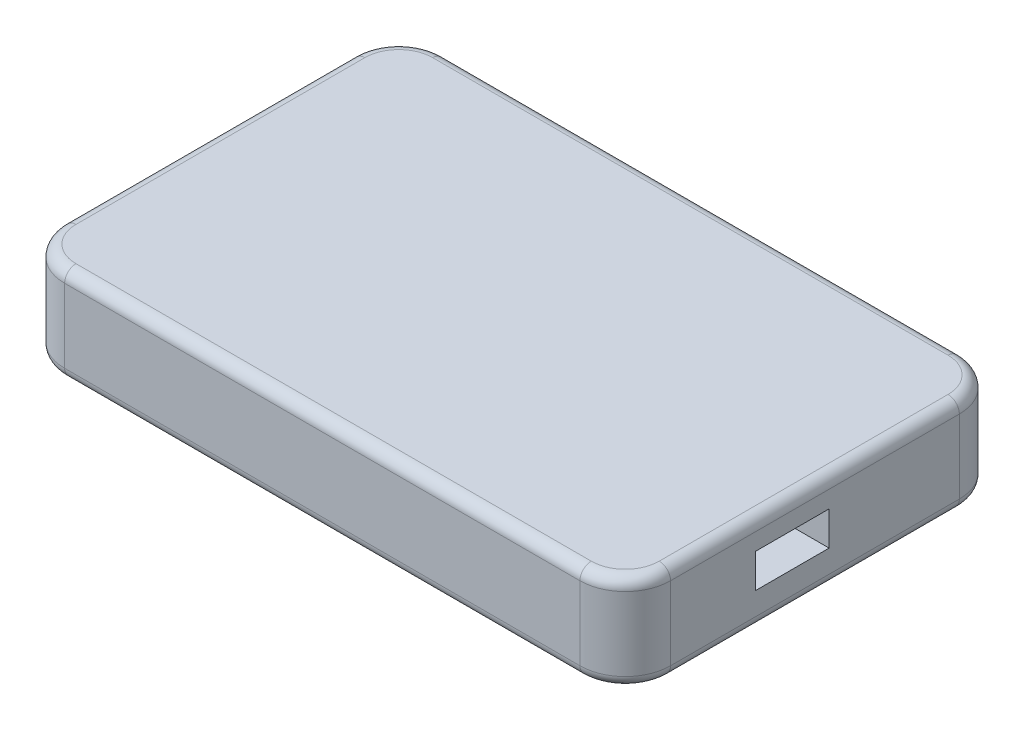
ISO-10303-21;
HEADER;
FILE_DESCRIPTION(('STEP AP214'),'2;1');
FILE_NAME('part.step','',(''),(''),'','','');
FILE_SCHEMA(('AUTOMOTIVE_DESIGN { 1 0 10303 214 1 1 1 1 }'));
ENDSEC;
DATA;
#1=APPLICATION_CONTEXT('core data for automotive mechanical design processes');
#2=APPLICATION_PROTOCOL_DEFINITION('international standard','automotive_design',2000,#1);
#3=PRODUCT_CONTEXT('',#1,'mechanical');
#4=PRODUCT('Part','Part','',(#3));
#5=PRODUCT_RELATED_PRODUCT_CATEGORY('part','',(#4));
#6=PRODUCT_DEFINITION_FORMATION('','',#4);
#7=PRODUCT_DEFINITION_CONTEXT('part definition',#1,'design');
#8=PRODUCT_DEFINITION('design','',#6,#7);
#9=PRODUCT_DEFINITION_SHAPE('','',#8);
#10=(LENGTH_UNIT() NAMED_UNIT(*) SI_UNIT(.MILLI.,.METRE.));
#11=(NAMED_UNIT(*) PLANE_ANGLE_UNIT() SI_UNIT($,.RADIAN.));
#12=(NAMED_UNIT(*) SI_UNIT($,.STERADIAN.) SOLID_ANGLE_UNIT());
#13=UNCERTAINTY_MEASURE_WITH_UNIT(LENGTH_MEASURE(1.E-05),#10,'distance_accuracy_value','');
#14=(GEOMETRIC_REPRESENTATION_CONTEXT(3) GLOBAL_UNCERTAINTY_ASSIGNED_CONTEXT((#13)) GLOBAL_UNIT_ASSIGNED_CONTEXT((#10,
#11,#12)) REPRESENTATION_CONTEXT('',''));
#15=CARTESIAN_POINT('',(0.,0.,0.));
#16=DIRECTION('',(0.,0.,1.));
#17=DIRECTION('',(1.,0.,0.));
#18=AXIS2_PLACEMENT_3D('',#15,#16,#17);
#19=CARTESIAN_POINT('',(53.5,17.,0.));
#20=DIRECTION('',(0.,-1.,0.));
#21=DIRECTION('',(0.,0.,-1.));
#22=AXIS2_PLACEMENT_3D('',#19,#20,#21);
#23=PLANE('',#22);
#24=CARTESIAN_POINT('',(-45.5,17.,-8.));
#25=DIRECTION('',(0.,-1.,0.));
#26=DIRECTION('',(0.,0.,-1.));
#27=AXIS2_PLACEMENT_3D('',#24,#25,#26);
#28=CIRCLE('',#27,6.);
#29=CARTESIAN_POINT('',(-45.5,17.,-2.));
#30=VERTEX_POINT('',#29);
#31=CARTESIAN_POINT('',(-51.5,17.,-8.));
#32=VERTEX_POINT('',#31);
#33=EDGE_CURVE('E328',#30,#32,#28,.T.);
#34=ORIENTED_EDGE('',*,*,#33,.F.);
#35=DIRECTION('',(-1.,0.,0.));
#36=VECTOR('',#35,1.);
#37=CARTESIAN_POINT('',(53.5,17.,-2.));
#38=LINE('',#37,#36);
#39=CARTESIAN_POINT('',(45.5,17.,-2.));
#40=VERTEX_POINT('',#39);
#41=EDGE_CURVE('E257',#30,#40,#38,.F.);
#42=ORIENTED_EDGE('',*,*,#41,.T.);
#43=CARTESIAN_POINT('',(45.5,17.,-8.));
#44=DIRECTION('',(0.,-1.,0.));
#45=DIRECTION('',(0.,0.,-1.));
#46=AXIS2_PLACEMENT_3D('',#43,#44,#45);
#47=CIRCLE('',#46,6.);
#48=CARTESIAN_POINT('',(51.5,17.,-8.));
#49=VERTEX_POINT('',#48);
#50=EDGE_CURVE('E324',#49,#40,#47,.T.);
#51=ORIENTED_EDGE('',*,*,#50,.F.);
#52=DIRECTION('',(0.,0.,1.));
#53=VECTOR('',#52,1.);
#54=CARTESIAN_POINT('',(51.5,17.,0.));
#55=LINE('',#54,#53);
#56=CARTESIAN_POINT('',(51.5,17.,-59.));
#57=VERTEX_POINT('',#56);
#58=EDGE_CURVE('E261',#49,#57,#55,.F.);
#59=ORIENTED_EDGE('',*,*,#58,.T.);
#60=CARTESIAN_POINT('',(45.5,17.,-59.));
#61=DIRECTION('',(0.,-1.,0.));
#62=DIRECTION('',(0.,0.,-1.));
#63=AXIS2_PLACEMENT_3D('',#60,#61,#62);
#64=CIRCLE('',#63,6.);
#65=CARTESIAN_POINT('',(45.5,17.,-65.));
#66=VERTEX_POINT('',#65);
#67=EDGE_CURVE('E321',#66,#57,#64,.T.);
#68=ORIENTED_EDGE('',*,*,#67,.F.);
#69=DIRECTION('',(-1.,0.,0.));
#70=VECTOR('',#69,1.);
#71=CARTESIAN_POINT('',(53.5,17.,-65.));
#72=LINE('',#71,#70);
#73=CARTESIAN_POINT('',(-45.5,17.,-65.));
#74=VERTEX_POINT('',#73);
#75=EDGE_CURVE('E269',#66,#74,#72,.T.);
#76=ORIENTED_EDGE('',*,*,#75,.T.);
#77=CARTESIAN_POINT('',(-45.5,17.,-59.));
#78=DIRECTION('',(0.,-1.,0.));
#79=DIRECTION('',(0.,0.,-1.));
#80=AXIS2_PLACEMENT_3D('',#77,#78,#79);
#81=CIRCLE('',#80,6.);
#82=CARTESIAN_POINT('',(-51.5,17.,-59.));
#83=VERTEX_POINT('',#82);
#84=EDGE_CURVE('E318',#83,#74,#81,.T.);
#85=ORIENTED_EDGE('',*,*,#84,.F.);
#86=DIRECTION('',(0.,0.,1.));
#87=VECTOR('',#86,1.);
#88=CARTESIAN_POINT('',(-51.5,17.,0.));
#89=LINE('',#88,#87);
#90=EDGE_CURVE('E265',#83,#32,#89,.T.);
#91=ORIENTED_EDGE('',*,*,#90,.T.);
#92=EDGE_LOOP('',(#34,#42,#51,#59,#68,#76,#85,#91));
#93=FACE_BOUND('',#92,.T.);
#94=ADVANCED_FACE('F41',(#93),#23,.F.);
#95=CARTESIAN_POINT('',(53.5,0.,0.));
#96=DIRECTION('',(0.,1.,0.));
#97=DIRECTION('',(0.,0.,1.));
#98=AXIS2_PLACEMENT_3D('',#95,#96,#97);
#99=PLANE('',#98);
#100=CARTESIAN_POINT('',(-45.5,0.,-8.));
#101=DIRECTION('',(0.,1.,0.));
#102=DIRECTION('',(0.,0.,1.));
#103=AXIS2_PLACEMENT_3D('',#100,#101,#102);
#104=CIRCLE('',#103,6.);
#105=CARTESIAN_POINT('',(-51.5,0.,-8.));
#106=VERTEX_POINT('',#105);
#107=CARTESIAN_POINT('',(-45.5,0.,-2.));
#108=VERTEX_POINT('',#107);
#109=EDGE_CURVE('E315',#106,#108,#104,.T.);
#110=ORIENTED_EDGE('',*,*,#109,.F.);
#111=DIRECTION('',(0.,0.,-1.));
#112=VECTOR('',#111,1.);
#113=CARTESIAN_POINT('',(-51.5,0.,-67.));
#114=LINE('',#113,#112);
#115=CARTESIAN_POINT('',(-51.5,0.,-59.));
#116=VERTEX_POINT('',#115);
#117=EDGE_CURVE('E242',#106,#116,#114,.T.);
#118=ORIENTED_EDGE('',*,*,#117,.T.);
#119=CARTESIAN_POINT('',(-45.5,0.,-59.));
#120=DIRECTION('',(0.,1.,0.));
#121=DIRECTION('',(0.,0.,1.));
#122=AXIS2_PLACEMENT_3D('',#119,#120,#121);
#123=CIRCLE('',#122,6.);
#124=CARTESIAN_POINT('',(-45.5,0.,-65.));
#125=VERTEX_POINT('',#124);
#126=EDGE_CURVE('E304',#125,#116,#123,.T.);
#127=ORIENTED_EDGE('',*,*,#126,.F.);
#128=DIRECTION('',(-1.,0.,0.));
#129=VECTOR('',#128,1.);
#130=CARTESIAN_POINT('',(53.5,0.,-65.));
#131=LINE('',#130,#129);
#132=CARTESIAN_POINT('',(45.5,0.,-65.));
#133=VERTEX_POINT('',#132);
#134=EDGE_CURVE('E246',#125,#133,#131,.F.);
#135=ORIENTED_EDGE('',*,*,#134,.T.);
#136=CARTESIAN_POINT('',(45.5,0.,-59.));
#137=DIRECTION('',(0.,1.,0.));
#138=DIRECTION('',(0.,0.,1.));
#139=AXIS2_PLACEMENT_3D('',#136,#137,#138);
#140=CIRCLE('',#139,6.);
#141=CARTESIAN_POINT('',(51.5,0.,-59.));
#142=VERTEX_POINT('',#141);
#143=EDGE_CURVE('E308',#142,#133,#140,.T.);
#144=ORIENTED_EDGE('',*,*,#143,.F.);
#145=DIRECTION('',(0.,0.,-1.));
#146=VECTOR('',#145,1.);
#147=CARTESIAN_POINT('',(51.5,0.,0.));
#148=LINE('',#147,#146);
#149=CARTESIAN_POINT('',(51.5,0.,-8.));
#150=VERTEX_POINT('',#149);
#151=EDGE_CURVE('E237',#142,#150,#148,.F.);
#152=ORIENTED_EDGE('',*,*,#151,.T.);
#153=CARTESIAN_POINT('',(45.5,0.,-8.));
#154=DIRECTION('',(0.,1.,0.));
#155=DIRECTION('',(0.,0.,1.));
#156=AXIS2_PLACEMENT_3D('',#153,#154,#155);
#157=CIRCLE('',#156,6.);
#158=CARTESIAN_POINT('',(45.5,0.,-2.));
#159=VERTEX_POINT('',#158);
#160=EDGE_CURVE('E312',#159,#150,#157,.T.);
#161=ORIENTED_EDGE('',*,*,#160,.F.);
#162=DIRECTION('',(-1.,0.,0.));
#163=VECTOR('',#162,1.);
#164=CARTESIAN_POINT('',(53.5,0.,-2.));
#165=LINE('',#164,#163);
#166=EDGE_CURVE('E233',#159,#108,#165,.T.);
#167=ORIENTED_EDGE('',*,*,#166,.T.);
#168=EDGE_LOOP('',(#110,#118,#127,#135,#144,#152,#161,#167));
#169=FACE_BOUND('',#168,.T.);
#170=ADVANCED_FACE('F436',(#169),#99,.F.);
#171=CARTESIAN_POINT('',(53.5,0.,0.));
#172=DIRECTION('',(0.,0.,-1.));
#173=DIRECTION('',(-1.,0.,0.));
#174=AXIS2_PLACEMENT_3D('',#171,#172,#173);
#175=PLANE('',#174);
#176=DIRECTION('',(-1.,0.,0.));
#177=VECTOR('',#176,1.);
#178=CARTESIAN_POINT('',(53.5,2.,0.));
#179=LINE('',#178,#177);
#180=CARTESIAN_POINT('',(-45.5,2.,0.));
#181=VERTEX_POINT('',#180);
#182=CARTESIAN_POINT('',(45.5,2.,0.));
#183=VERTEX_POINT('',#182);
#184=EDGE_CURVE('E293',#181,#183,#179,.F.);
#185=ORIENTED_EDGE('',*,*,#184,.T.);
#186=DIRECTION('',(0.,-1.,0.));
#187=VECTOR('',#186,1.);
#188=CARTESIAN_POINT('',(45.5,0.,0.));
#189=LINE('',#188,#187);
#190=CARTESIAN_POINT('',(45.5,15.,0.));
#191=VERTEX_POINT('',#190);
#192=EDGE_CURVE('E11',#183,#191,#189,.F.);
#193=ORIENTED_EDGE('',*,*,#192,.T.);
#194=DIRECTION('',(-1.,0.,0.));
#195=VECTOR('',#194,1.);
#196=CARTESIAN_POINT('',(53.5,15.,0.));
#197=LINE('',#196,#195);
#198=CARTESIAN_POINT('',(-45.5,15.,0.));
#199=VERTEX_POINT('',#198);
#200=EDGE_CURVE('E289',#191,#199,#197,.T.);
#201=ORIENTED_EDGE('',*,*,#200,.T.);
#202=DIRECTION('',(0.,-1.,0.));
#203=VECTOR('',#202,1.);
#204=CARTESIAN_POINT('',(-45.5,2.,0.));
#205=LINE('',#204,#203);
#206=EDGE_CURVE('E51',#199,#181,#205,.T.);
#207=ORIENTED_EDGE('',*,*,#206,.T.);
#208=EDGE_LOOP('',(#185,#193,#201,#207));
#209=FACE_BOUND('',#208,.T.);
#210=ADVANCED_FACE('F520',(#209),#175,.F.);
#211=CARTESIAN_POINT('',(53.5,0.,-67.));
#212=DIRECTION('',(0.,0.,1.));
#213=DIRECTION('',(1.,0.,0.));
#214=AXIS2_PLACEMENT_3D('',#211,#212,#213);
#215=PLANE('',#214);
#216=DIRECTION('',(-1.,0.,0.));
#217=VECTOR('',#216,1.);
#218=CARTESIAN_POINT('',(53.5,2.,-67.));
#219=LINE('',#218,#217);
#220=CARTESIAN_POINT('',(45.5,2.,-67.));
#221=VERTEX_POINT('',#220);
#222=CARTESIAN_POINT('',(-45.5,2.,-67.));
#223=VERTEX_POINT('',#222);
#224=EDGE_CURVE('E285',#221,#223,#219,.T.);
#225=ORIENTED_EDGE('',*,*,#224,.T.);
#226=DIRECTION('',(0.,1.,0.));
#227=VECTOR('',#226,1.);
#228=CARTESIAN_POINT('',(-45.5,15.,-67.));
#229=LINE('',#228,#227);
#230=CARTESIAN_POINT('',(-45.5,15.,-67.));
#231=VERTEX_POINT('',#230);
#232=EDGE_CURVE('E379',#223,#231,#229,.T.);
#233=ORIENTED_EDGE('',*,*,#232,.T.);
#234=DIRECTION('',(-1.,0.,0.));
#235=VECTOR('',#234,1.);
#236=CARTESIAN_POINT('',(53.5,15.,-67.));
#237=LINE('',#236,#235);
#238=CARTESIAN_POINT('',(45.5,15.,-67.));
#239=VERTEX_POINT('',#238);
#240=EDGE_CURVE('E281',#231,#239,#237,.F.);
#241=ORIENTED_EDGE('',*,*,#240,.T.);
#242=DIRECTION('',(0.,1.,0.));
#243=VECTOR('',#242,1.);
#244=CARTESIAN_POINT('',(45.5,0.,-67.));
#245=LINE('',#244,#243);
#246=EDGE_CURVE('E376',#239,#221,#245,.F.);
#247=ORIENTED_EDGE('',*,*,#246,.T.);
#248=EDGE_LOOP('',(#225,#233,#241,#247));
#249=FACE_BOUND('',#248,.T.);
#250=ADVANCED_FACE('F525',(#249),#215,.F.);
#251=CARTESIAN_POINT('',(53.5,0.,0.));
#252=DIRECTION('',(-1.,0.,0.));
#253=DIRECTION('',(0.,0.,1.));
#254=AXIS2_PLACEMENT_3D('',#251,#252,#253);
#255=PLANE('',#254);
#256=DIRECTION('',(0.,0.,-1.));
#257=VECTOR('',#256,1.);
#258=CARTESIAN_POINT('',(53.5,6.,-23.));
#259=LINE('',#258,#257);
#260=CARTESIAN_POINT('',(53.5,6.,-23.));
#261=VERTEX_POINT('',#260);
#262=CARTESIAN_POINT('',(53.5,6.,-36.));
#263=VERTEX_POINT('',#262);
#264=EDGE_CURVE('E218',#261,#263,#259,.T.);
#265=ORIENTED_EDGE('',*,*,#264,.F.);
#266=DIRECTION('',(0.,-1.,0.));
#267=VECTOR('',#266,1.);
#268=CARTESIAN_POINT('',(53.5,12.,-23.));
#269=LINE('',#268,#267);
#270=CARTESIAN_POINT('',(53.5,12.,-23.));
#271=VERTEX_POINT('',#270);
#272=EDGE_CURVE('E59',#271,#261,#269,.T.);
#273=ORIENTED_EDGE('',*,*,#272,.F.);
#274=DIRECTION('',(0.,0.,1.));
#275=VECTOR('',#274,1.);
#276=CARTESIAN_POINT('',(53.5,12.,-23.));
#277=LINE('',#276,#275);
#278=CARTESIAN_POINT('',(53.5,12.,-36.));
#279=VERTEX_POINT('',#278);
#280=EDGE_CURVE('E205',#279,#271,#277,.T.);
#281=ORIENTED_EDGE('',*,*,#280,.F.);
#282=DIRECTION('',(0.,1.,0.));
#283=VECTOR('',#282,1.);
#284=CARTESIAN_POINT('',(53.5,12.,-36.));
#285=LINE('',#284,#283);
#286=EDGE_CURVE('E209',#263,#279,#285,.T.);
#287=ORIENTED_EDGE('',*,*,#286,.F.);
#288=EDGE_LOOP('',(#265,#273,#281,#287));
#289=FACE_BOUND('',#288,.T.);
#290=DIRECTION('',(0.,0.,-1.));
#291=VECTOR('',#290,1.);
#292=CARTESIAN_POINT('',(53.5,2.,0.));
#293=LINE('',#292,#291);
#294=CARTESIAN_POINT('',(53.5,2.,-8.));
#295=VERTEX_POINT('',#294);
#296=CARTESIAN_POINT('',(53.5,2.,-59.));
#297=VERTEX_POINT('',#296);
#298=EDGE_CURVE('E277',#295,#297,#293,.T.);
#299=ORIENTED_EDGE('',*,*,#298,.T.);
#300=DIRECTION('',(0.,1.,0.));
#301=VECTOR('',#300,1.);
#302=CARTESIAN_POINT('',(53.5,0.,-59.));
#303=LINE('',#302,#301);
#304=CARTESIAN_POINT('',(53.5,15.,-59.));
#305=VERTEX_POINT('',#304);
#306=EDGE_CURVE('E391',#297,#305,#303,.T.);
#307=ORIENTED_EDGE('',*,*,#306,.T.);
#308=DIRECTION('',(0.,0.,1.));
#309=VECTOR('',#308,1.);
#310=CARTESIAN_POINT('',(53.5,15.,0.));
#311=LINE('',#310,#309);
#312=CARTESIAN_POINT('',(53.5,15.,-8.));
#313=VERTEX_POINT('',#312);
#314=EDGE_CURVE('E273',#305,#313,#311,.T.);
#315=ORIENTED_EDGE('',*,*,#314,.T.);
#316=DIRECTION('',(0.,-1.,0.));
#317=VECTOR('',#316,1.);
#318=CARTESIAN_POINT('',(53.5,0.,-8.));
#319=LINE('',#318,#317);
#320=EDGE_CURVE('E388',#313,#295,#319,.T.);
#321=ORIENTED_EDGE('',*,*,#320,.T.);
#322=EDGE_LOOP('',(#299,#307,#315,#321));
#323=FACE_BOUND('',#322,.T.);
#324=ADVANCED_FACE('F481',(#289,#323),#255,.F.);
#325=CARTESIAN_POINT('',(-53.5,0.,0.));
#326=DIRECTION('',(-1.,0.,0.));
#327=DIRECTION('',(0.,0.,1.));
#328=AXIS2_PLACEMENT_3D('',#325,#326,#327);
#329=PLANE('',#328);
#330=DIRECTION('',(0.,0.,1.));
#331=VECTOR('',#330,1.);
#332=CARTESIAN_POINT('',(-53.5,15.,-67.));
#333=LINE('',#332,#331);
#334=CARTESIAN_POINT('',(-53.5,15.,-8.));
#335=VERTEX_POINT('',#334);
#336=CARTESIAN_POINT('',(-53.5,15.,-59.));
#337=VERTEX_POINT('',#336);
#338=EDGE_CURVE('E250',#335,#337,#333,.F.);
#339=ORIENTED_EDGE('',*,*,#338,.T.);
#340=DIRECTION('',(0.,1.,0.));
#341=VECTOR('',#340,1.);
#342=CARTESIAN_POINT('',(-53.5,2.,-59.));
#343=LINE('',#342,#341);
#344=CARTESIAN_POINT('',(-53.5,2.,-59.));
#345=VERTEX_POINT('',#344);
#346=EDGE_CURVE('E385',#337,#345,#343,.F.);
#347=ORIENTED_EDGE('',*,*,#346,.T.);
#348=DIRECTION('',(0.,0.,-1.));
#349=VECTOR('',#348,1.);
#350=CARTESIAN_POINT('',(-53.5,2.,0.));
#351=LINE('',#350,#349);
#352=CARTESIAN_POINT('',(-53.5,2.,-8.));
#353=VERTEX_POINT('',#352);
#354=EDGE_CURVE('E254',#345,#353,#351,.F.);
#355=ORIENTED_EDGE('',*,*,#354,.T.);
#356=DIRECTION('',(0.,-1.,0.));
#357=VECTOR('',#356,1.);
#358=CARTESIAN_POINT('',(-53.5,15.,-8.));
#359=LINE('',#358,#357);
#360=EDGE_CURVE('E382',#353,#335,#359,.F.);
#361=ORIENTED_EDGE('',*,*,#360,.T.);
#362=EDGE_LOOP('',(#339,#347,#355,#361));
#363=FACE_BOUND('',#362,.T.);
#364=ADVANCED_FACE('F456',(#363),#329,.T.);
#365=CARTESIAN_POINT('',(51.5,2.,0.));
#366=DIRECTION('',(0.,0.,-1.));
#367=DIRECTION('',(-1.,0.,0.));
#368=AXIS2_PLACEMENT_3D('',#365,#366,#367);
#369=CYLINDRICAL_SURFACE('',#368,2.);
#370=ORIENTED_EDGE('',*,*,#298,.F.);
#371=CARTESIAN_POINT('',(51.5,2.,-8.));
#372=DIRECTION('',(0.,0.,-1.));
#373=DIRECTION('',(-1.,0.,0.));
#374=AXIS2_PLACEMENT_3D('',#371,#372,#373);
#375=CIRCLE('',#374,2.);
#376=EDGE_CURVE('E341',#295,#150,#375,.T.);
#377=ORIENTED_EDGE('',*,*,#376,.T.);
#378=ORIENTED_EDGE('',*,*,#151,.F.);
#379=CARTESIAN_POINT('',(51.5,2.,-59.));
#380=DIRECTION('',(0.,0.,1.));
#381=DIRECTION('',(1.,0.,0.));
#382=AXIS2_PLACEMENT_3D('',#379,#380,#381);
#383=CIRCLE('',#382,2.);
#384=EDGE_CURVE('E338',#142,#297,#383,.T.);
#385=ORIENTED_EDGE('',*,*,#384,.T.);
#386=EDGE_LOOP('',(#370,#377,#378,#385));
#387=FACE_BOUND('',#386,.T.);
#388=ADVANCED_FACE('F485',(#387),#369,.T.);
#389=CARTESIAN_POINT('',(53.5,2.,-2.));
#390=DIRECTION('',(-1.,0.,0.));
#391=DIRECTION('',(0.,0.,1.));
#392=AXIS2_PLACEMENT_3D('',#389,#390,#391);
#393=CYLINDRICAL_SURFACE('',#392,2.);
#394=ORIENTED_EDGE('',*,*,#184,.F.);
#395=CARTESIAN_POINT('',(-45.5,2.,-2.));
#396=DIRECTION('',(1.,0.,0.));
#397=DIRECTION('',(0.,0.,-1.));
#398=AXIS2_PLACEMENT_3D('',#395,#396,#397);
#399=CIRCLE('',#398,2.);
#400=EDGE_CURVE('E300',#181,#108,#399,.T.);
#401=ORIENTED_EDGE('',*,*,#400,.T.);
#402=ORIENTED_EDGE('',*,*,#166,.F.);
#403=CARTESIAN_POINT('',(45.5,2.,-2.));
#404=DIRECTION('',(-1.,0.,0.));
#405=DIRECTION('',(0.,0.,1.));
#406=AXIS2_PLACEMENT_3D('',#403,#404,#405);
#407=CIRCLE('',#406,2.);
#408=EDGE_CURVE('E297',#159,#183,#407,.T.);
#409=ORIENTED_EDGE('',*,*,#408,.T.);
#410=EDGE_LOOP('',(#394,#401,#402,#409));
#411=FACE_BOUND('',#410,.T.);
#412=ADVANCED_FACE('F444',(#411),#393,.T.);
#413=CARTESIAN_POINT('',(53.5,2.,-65.));
#414=DIRECTION('',(-1.,0.,0.));
#415=DIRECTION('',(0.,0.,1.));
#416=AXIS2_PLACEMENT_3D('',#413,#414,#415);
#417=CYLINDRICAL_SURFACE('',#416,2.);
#418=ORIENTED_EDGE('',*,*,#224,.F.);
#419=CARTESIAN_POINT('',(45.5,2.,-65.));
#420=DIRECTION('',(-1.,0.,0.));
#421=DIRECTION('',(0.,0.,1.));
#422=AXIS2_PLACEMENT_3D('',#419,#420,#421);
#423=CIRCLE('',#422,2.);
#424=EDGE_CURVE('E361',#221,#133,#423,.T.);
#425=ORIENTED_EDGE('',*,*,#424,.T.);
#426=ORIENTED_EDGE('',*,*,#134,.F.);
#427=CARTESIAN_POINT('',(-45.5,2.,-65.));
#428=DIRECTION('',(1.,0.,0.));
#429=DIRECTION('',(0.,0.,-1.));
#430=AXIS2_PLACEMENT_3D('',#427,#428,#429);
#431=CIRCLE('',#430,2.);
#432=EDGE_CURVE('E358',#125,#223,#431,.T.);
#433=ORIENTED_EDGE('',*,*,#432,.T.);
#434=EDGE_LOOP('',(#418,#425,#426,#433));
#435=FACE_BOUND('',#434,.T.);
#436=ADVANCED_FACE('F533',(#435),#417,.T.);
#437=CARTESIAN_POINT('',(-51.5,2.,0.));
#438=DIRECTION('',(0.,0.,1.));
#439=DIRECTION('',(1.,0.,0.));
#440=AXIS2_PLACEMENT_3D('',#437,#438,#439);
#441=CYLINDRICAL_SURFACE('',#440,2.);
#442=ORIENTED_EDGE('',*,*,#354,.F.);
#443=CARTESIAN_POINT('',(-51.5,2.,-59.));
#444=DIRECTION('',(0.,0.,1.));
#445=DIRECTION('',(1.,0.,0.));
#446=AXIS2_PLACEMENT_3D('',#443,#444,#445);
#447=CIRCLE('',#446,2.);
#448=EDGE_CURVE('E373',#345,#116,#447,.T.);
#449=ORIENTED_EDGE('',*,*,#448,.T.);
#450=ORIENTED_EDGE('',*,*,#117,.F.);
#451=CARTESIAN_POINT('',(-51.5,2.,-8.));
#452=DIRECTION('',(0.,0.,-1.));
#453=DIRECTION('',(-1.,0.,0.));
#454=AXIS2_PLACEMENT_3D('',#451,#452,#453);
#455=CIRCLE('',#454,2.);
#456=EDGE_CURVE('E67',#106,#353,#455,.T.);
#457=ORIENTED_EDGE('',*,*,#456,.T.);
#458=EDGE_LOOP('',(#442,#449,#450,#457));
#459=FACE_BOUND('',#458,.T.);
#460=ADVANCED_FACE('F434',(#459),#441,.T.);
#461=CARTESIAN_POINT('',(51.5,15.,0.));
#462=DIRECTION('',(0.,0.,1.));
#463=DIRECTION('',(1.,0.,0.));
#464=AXIS2_PLACEMENT_3D('',#461,#462,#463);
#465=CYLINDRICAL_SURFACE('',#464,2.);
#466=ORIENTED_EDGE('',*,*,#314,.F.);
#467=CARTESIAN_POINT('',(51.5,15.,-59.));
#468=DIRECTION('',(0.,0.,1.));
#469=DIRECTION('',(1.,0.,0.));
#470=AXIS2_PLACEMENT_3D('',#467,#468,#469);
#471=CIRCLE('',#470,2.);
#472=EDGE_CURVE('E354',#305,#57,#471,.T.);
#473=ORIENTED_EDGE('',*,*,#472,.T.);
#474=ORIENTED_EDGE('',*,*,#58,.F.);
#475=CARTESIAN_POINT('',(51.5,15.,-8.));
#476=DIRECTION('',(0.,0.,-1.));
#477=DIRECTION('',(-1.,0.,0.));
#478=AXIS2_PLACEMENT_3D('',#475,#476,#477);
#479=CIRCLE('',#478,2.);
#480=EDGE_CURVE('E351',#49,#313,#479,.T.);
#481=ORIENTED_EDGE('',*,*,#480,.T.);
#482=EDGE_LOOP('',(#466,#473,#474,#481));
#483=FACE_BOUND('',#482,.T.);
#484=ADVANCED_FACE('F498',(#483),#465,.T.);
#485=CARTESIAN_POINT('',(53.5,15.,-65.));
#486=DIRECTION('',(-1.,0.,0.));
#487=DIRECTION('',(0.,0.,1.));
#488=AXIS2_PLACEMENT_3D('',#485,#486,#487);
#489=CYLINDRICAL_SURFACE('',#488,2.);
#490=ORIENTED_EDGE('',*,*,#240,.F.);
#491=CARTESIAN_POINT('',(-45.5,15.,-65.));
#492=DIRECTION('',(1.,0.,0.));
#493=DIRECTION('',(0.,0.,-1.));
#494=AXIS2_PLACEMENT_3D('',#491,#492,#493);
#495=CIRCLE('',#494,2.);
#496=EDGE_CURVE('E367',#231,#74,#495,.T.);
#497=ORIENTED_EDGE('',*,*,#496,.T.);
#498=ORIENTED_EDGE('',*,*,#75,.F.);
#499=CARTESIAN_POINT('',(45.5,15.,-65.));
#500=DIRECTION('',(-1.,0.,0.));
#501=DIRECTION('',(0.,0.,1.));
#502=AXIS2_PLACEMENT_3D('',#499,#500,#501);
#503=CIRCLE('',#502,2.);
#504=EDGE_CURVE('E364',#66,#239,#503,.T.);
#505=ORIENTED_EDGE('',*,*,#504,.T.);
#506=EDGE_LOOP('',(#490,#497,#498,#505));
#507=FACE_BOUND('',#506,.T.);
#508=ADVANCED_FACE('F505',(#507),#489,.T.);
#509=CARTESIAN_POINT('',(53.5,15.,-2.));
#510=DIRECTION('',(-1.,0.,0.));
#511=DIRECTION('',(0.,0.,1.));
#512=AXIS2_PLACEMENT_3D('',#509,#510,#511);
#513=CYLINDRICAL_SURFACE('',#512,2.);
#514=ORIENTED_EDGE('',*,*,#200,.F.);
#515=CARTESIAN_POINT('',(45.5,15.,-2.));
#516=DIRECTION('',(-1.,0.,0.));
#517=DIRECTION('',(0.,0.,1.));
#518=AXIS2_PLACEMENT_3D('',#515,#516,#517);
#519=CIRCLE('',#518,2.);
#520=EDGE_CURVE('E348',#191,#40,#519,.T.);
#521=ORIENTED_EDGE('',*,*,#520,.T.);
#522=ORIENTED_EDGE('',*,*,#41,.F.);
#523=CARTESIAN_POINT('',(-45.5,15.,-2.));
#524=DIRECTION('',(1.,0.,0.));
#525=DIRECTION('',(0.,0.,-1.));
#526=AXIS2_PLACEMENT_3D('',#523,#524,#525);
#527=CIRCLE('',#526,2.);
#528=EDGE_CURVE('E345',#30,#199,#527,.T.);
#529=ORIENTED_EDGE('',*,*,#528,.T.);
#530=EDGE_LOOP('',(#514,#521,#522,#529));
#531=FACE_BOUND('',#530,.T.);
#532=ADVANCED_FACE('F468',(#531),#513,.T.);
#533=CARTESIAN_POINT('',(-51.5,15.,0.));
#534=DIRECTION('',(0.,0.,-1.));
#535=DIRECTION('',(-1.,0.,0.));
#536=AXIS2_PLACEMENT_3D('',#533,#534,#535);
#537=CYLINDRICAL_SURFACE('',#536,2.);
#538=ORIENTED_EDGE('',*,*,#338,.F.);
#539=CARTESIAN_POINT('',(-51.5,15.,-8.));
#540=DIRECTION('',(0.,0.,-1.));
#541=DIRECTION('',(-1.,0.,0.));
#542=AXIS2_PLACEMENT_3D('',#539,#540,#541);
#543=CIRCLE('',#542,2.);
#544=EDGE_CURVE('E335',#335,#32,#543,.T.);
#545=ORIENTED_EDGE('',*,*,#544,.T.);
#546=ORIENTED_EDGE('',*,*,#90,.F.);
#547=CARTESIAN_POINT('',(-51.5,15.,-59.));
#548=DIRECTION('',(0.,0.,1.));
#549=DIRECTION('',(1.,0.,0.));
#550=AXIS2_PLACEMENT_3D('',#547,#548,#549);
#551=CIRCLE('',#550,2.);
#552=EDGE_CURVE('E332',#83,#337,#551,.T.);
#553=ORIENTED_EDGE('',*,*,#552,.T.);
#554=EDGE_LOOP('',(#538,#545,#546,#553));
#555=FACE_BOUND('',#554,.T.);
#556=ADVANCED_FACE('F459',(#555),#537,.T.);
#557=CARTESIAN_POINT('',(-45.5,15.,-8.));
#558=DIRECTION('',(0.,-1.,0.));
#559=DIRECTION('',(0.,0.,-1.));
#560=AXIS2_PLACEMENT_3D('',#557,#558,#559);
#561=TOROIDAL_SURFACE('',#560,6.,2.);
#562=ORIENTED_EDGE('',*,*,#33,.T.);
#563=ORIENTED_EDGE('',*,*,#544,.F.);
#564=CARTESIAN_POINT('',(-45.5,15.,-8.));
#565=DIRECTION('',(0.,-1.,0.));
#566=DIRECTION('',(0.,0.,-1.));
#567=AXIS2_PLACEMENT_3D('',#564,#565,#566);
#568=CIRCLE('',#567,8.);
#569=EDGE_CURVE('E238',#199,#335,#568,.T.);
#570=ORIENTED_EDGE('',*,*,#569,.F.);
#571=ORIENTED_EDGE('',*,*,#528,.F.);
#572=EDGE_LOOP('',(#562,#563,#570,#571));
#573=FACE_BOUND('',#572,.T.);
#574=ADVANCED_FACE('F462',(#573),#561,.T.);
#575=CARTESIAN_POINT('',(-45.5,0.,-8.));
#576=DIRECTION('',(0.,1.,0.));
#577=DIRECTION('',(0.,0.,1.));
#578=AXIS2_PLACEMENT_3D('',#575,#576,#577);
#579=CYLINDRICAL_SURFACE('',#578,8.);
#580=ORIENTED_EDGE('',*,*,#569,.T.);
#581=ORIENTED_EDGE('',*,*,#360,.F.);
#582=CARTESIAN_POINT('',(-45.5,2.,-8.));
#583=DIRECTION('',(0.,1.,0.));
#584=DIRECTION('',(0.,0.,1.));
#585=AXIS2_PLACEMENT_3D('',#582,#583,#584);
#586=CIRCLE('',#585,8.);
#587=EDGE_CURVE('E396',#181,#353,#586,.F.);
#588=ORIENTED_EDGE('',*,*,#587,.F.);
#589=ORIENTED_EDGE('',*,*,#206,.F.);
#590=EDGE_LOOP('',(#580,#581,#588,#589));
#591=FACE_BOUND('',#590,.T.);
#592=ADVANCED_FACE('F452',(#591),#579,.T.);
#593=CARTESIAN_POINT('',(-45.5,2.,-8.));
#594=DIRECTION('',(0.,1.,0.));
#595=DIRECTION('',(0.,0.,1.));
#596=AXIS2_PLACEMENT_3D('',#593,#594,#595);
#597=TOROIDAL_SURFACE('',#596,6.,2.);
#598=ORIENTED_EDGE('',*,*,#400,.F.);
#599=ORIENTED_EDGE('',*,*,#587,.T.);
#600=ORIENTED_EDGE('',*,*,#456,.F.);
#601=ORIENTED_EDGE('',*,*,#109,.T.);
#602=EDGE_LOOP('',(#598,#599,#600,#601));
#603=FACE_BOUND('',#602,.T.);
#604=ADVANCED_FACE('F441',(#603),#597,.T.);
#605=CARTESIAN_POINT('',(45.5,15.,-8.));
#606=DIRECTION('',(0.,-1.,0.));
#607=DIRECTION('',(0.,0.,-1.));
#608=AXIS2_PLACEMENT_3D('',#605,#606,#607);
#609=TOROIDAL_SURFACE('',#608,6.,2.);
#610=ORIENTED_EDGE('',*,*,#50,.T.);
#611=ORIENTED_EDGE('',*,*,#520,.F.);
#612=CARTESIAN_POINT('',(45.5,15.,-8.));
#613=DIRECTION('',(0.,-1.,0.));
#614=DIRECTION('',(0.,0.,-1.));
#615=AXIS2_PLACEMENT_3D('',#612,#613,#614);
#616=CIRCLE('',#615,8.);
#617=EDGE_CURVE('E400',#313,#191,#616,.T.);
#618=ORIENTED_EDGE('',*,*,#617,.F.);
#619=ORIENTED_EDGE('',*,*,#480,.F.);
#620=EDGE_LOOP('',(#610,#611,#618,#619));
#621=FACE_BOUND('',#620,.T.);
#622=ADVANCED_FACE('F472',(#621),#609,.T.);
#623=CARTESIAN_POINT('',(45.5,0.,-8.));
#624=DIRECTION('',(0.,-1.,0.));
#625=DIRECTION('',(0.,0.,-1.));
#626=AXIS2_PLACEMENT_3D('',#623,#624,#625);
#627=CYLINDRICAL_SURFACE('',#626,8.);
#628=ORIENTED_EDGE('',*,*,#617,.T.);
#629=ORIENTED_EDGE('',*,*,#192,.F.);
#630=CARTESIAN_POINT('',(45.5,2.,-8.));
#631=DIRECTION('',(0.,1.,0.));
#632=DIRECTION('',(0.,0.,1.));
#633=AXIS2_PLACEMENT_3D('',#630,#631,#632);
#634=CIRCLE('',#633,8.);
#635=EDGE_CURVE('E404',#295,#183,#634,.F.);
#636=ORIENTED_EDGE('',*,*,#635,.F.);
#637=ORIENTED_EDGE('',*,*,#320,.F.);
#638=EDGE_LOOP('',(#628,#629,#636,#637));
#639=FACE_BOUND('',#638,.T.);
#640=ADVANCED_FACE('F476',(#639),#627,.T.);
#641=CARTESIAN_POINT('',(45.5,2.,-8.));
#642=DIRECTION('',(0.,1.,0.));
#643=DIRECTION('',(0.,0.,1.));
#644=AXIS2_PLACEMENT_3D('',#641,#642,#643);
#645=TOROIDAL_SURFACE('',#644,6.,2.);
#646=ORIENTED_EDGE('',*,*,#376,.F.);
#647=ORIENTED_EDGE('',*,*,#635,.T.);
#648=ORIENTED_EDGE('',*,*,#408,.F.);
#649=ORIENTED_EDGE('',*,*,#160,.T.);
#650=EDGE_LOOP('',(#646,#647,#648,#649));
#651=FACE_BOUND('',#650,.T.);
#652=ADVANCED_FACE('F555',(#651),#645,.T.);
#653=CARTESIAN_POINT('',(45.5,2.,-59.));
#654=DIRECTION('',(0.,1.,0.));
#655=DIRECTION('',(0.,0.,1.));
#656=AXIS2_PLACEMENT_3D('',#653,#654,#655);
#657=TOROIDAL_SURFACE('',#656,6.,2.);
#658=ORIENTED_EDGE('',*,*,#143,.T.);
#659=ORIENTED_EDGE('',*,*,#424,.F.);
#660=CARTESIAN_POINT('',(45.5,2.,-59.));
#661=DIRECTION('',(0.,1.,0.));
#662=DIRECTION('',(0.,0.,1.));
#663=AXIS2_PLACEMENT_3D('',#660,#661,#662);
#664=CIRCLE('',#663,8.);
#665=EDGE_CURVE('E408',#297,#221,#664,.T.);
#666=ORIENTED_EDGE('',*,*,#665,.F.);
#667=ORIENTED_EDGE('',*,*,#384,.F.);
#668=EDGE_LOOP('',(#658,#659,#666,#667));
#669=FACE_BOUND('',#668,.T.);
#670=ADVANCED_FACE('F489',(#669),#657,.T.);
#671=CARTESIAN_POINT('',(45.5,0.,-59.));
#672=DIRECTION('',(0.,1.,0.));
#673=DIRECTION('',(0.,0.,1.));
#674=AXIS2_PLACEMENT_3D('',#671,#672,#673);
#675=CYLINDRICAL_SURFACE('',#674,8.);
#676=ORIENTED_EDGE('',*,*,#665,.T.);
#677=ORIENTED_EDGE('',*,*,#246,.F.);
#678=CARTESIAN_POINT('',(45.5,15.,-59.));
#679=DIRECTION('',(0.,-1.,0.));
#680=DIRECTION('',(0.,0.,-1.));
#681=AXIS2_PLACEMENT_3D('',#678,#679,#680);
#682=CIRCLE('',#681,8.);
#683=EDGE_CURVE('E412',#305,#239,#682,.F.);
#684=ORIENTED_EDGE('',*,*,#683,.F.);
#685=ORIENTED_EDGE('',*,*,#306,.F.);
#686=EDGE_LOOP('',(#676,#677,#684,#685));
#687=FACE_BOUND('',#686,.T.);
#688=ADVANCED_FACE('F495',(#687),#675,.T.);
#689=CARTESIAN_POINT('',(45.5,15.,-59.));
#690=DIRECTION('',(0.,-1.,0.));
#691=DIRECTION('',(0.,0.,-1.));
#692=AXIS2_PLACEMENT_3D('',#689,#690,#691);
#693=TOROIDAL_SURFACE('',#692,6.,2.);
#694=ORIENTED_EDGE('',*,*,#472,.F.);
#695=ORIENTED_EDGE('',*,*,#683,.T.);
#696=ORIENTED_EDGE('',*,*,#504,.F.);
#697=ORIENTED_EDGE('',*,*,#67,.T.);
#698=EDGE_LOOP('',(#694,#695,#696,#697));
#699=FACE_BOUND('',#698,.T.);
#700=ADVANCED_FACE('F506',(#699),#693,.T.);
#701=CARTESIAN_POINT('',(-45.5,2.,-59.));
#702=DIRECTION('',(0.,1.,0.));
#703=DIRECTION('',(0.,0.,1.));
#704=AXIS2_PLACEMENT_3D('',#701,#702,#703);
#705=TOROIDAL_SURFACE('',#704,6.,2.);
#706=ORIENTED_EDGE('',*,*,#126,.T.);
#707=ORIENTED_EDGE('',*,*,#448,.F.);
#708=CARTESIAN_POINT('',(-45.5,2.,-59.));
#709=DIRECTION('',(0.,1.,0.));
#710=DIRECTION('',(0.,0.,1.));
#711=AXIS2_PLACEMENT_3D('',#708,#709,#710);
#712=CIRCLE('',#711,8.);
#713=EDGE_CURVE('E45',#223,#345,#712,.T.);
#714=ORIENTED_EDGE('',*,*,#713,.F.);
#715=ORIENTED_EDGE('',*,*,#432,.F.);
#716=EDGE_LOOP('',(#706,#707,#714,#715));
#717=FACE_BOUND('',#716,.T.);
#718=ADVANCED_FACE('F43',(#717),#705,.T.);
#719=CARTESIAN_POINT('',(-45.5,0.,-59.));
#720=DIRECTION('',(0.,-1.,0.));
#721=DIRECTION('',(0.,0.,-1.));
#722=AXIS2_PLACEMENT_3D('',#719,#720,#721);
#723=CYLINDRICAL_SURFACE('',#722,8.);
#724=ORIENTED_EDGE('',*,*,#713,.T.);
#725=ORIENTED_EDGE('',*,*,#346,.F.);
#726=CARTESIAN_POINT('',(-45.5,15.,-59.));
#727=DIRECTION('',(0.,-1.,0.));
#728=DIRECTION('',(0.,0.,-1.));
#729=AXIS2_PLACEMENT_3D('',#726,#727,#728);
#730=CIRCLE('',#729,8.);
#731=EDGE_CURVE('E227',#231,#337,#730,.F.);
#732=ORIENTED_EDGE('',*,*,#731,.F.);
#733=ORIENTED_EDGE('',*,*,#232,.F.);
#734=EDGE_LOOP('',(#724,#725,#732,#733));
#735=FACE_BOUND('',#734,.T.);
#736=ADVANCED_FACE('F430',(#735),#723,.T.);
#737=CARTESIAN_POINT('',(-45.5,15.,-59.));
#738=DIRECTION('',(0.,-1.,0.));
#739=DIRECTION('',(0.,0.,-1.));
#740=AXIS2_PLACEMENT_3D('',#737,#738,#739);
#741=TOROIDAL_SURFACE('',#740,6.,2.);
#742=ORIENTED_EDGE('',*,*,#496,.F.);
#743=ORIENTED_EDGE('',*,*,#731,.T.);
#744=ORIENTED_EDGE('',*,*,#552,.F.);
#745=ORIENTED_EDGE('',*,*,#84,.T.);
#746=EDGE_LOOP('',(#742,#743,#744,#745));
#747=FACE_BOUND('',#746,.T.);
#748=ADVANCED_FACE('F604',(#747),#741,.T.);
#749=CARTESIAN_POINT('',(45.5,12.,-23.));
#750=DIRECTION('',(0.,0.,1.));
#751=DIRECTION('',(1.,0.,0.));
#752=AXIS2_PLACEMENT_3D('',#749,#750,#751);
#753=PLANE('',#752);
#754=ORIENTED_EDGE('',*,*,#272,.T.);
#755=DIRECTION('',(1.,0.,0.));
#756=VECTOR('',#755,1.);
#757=CARTESIAN_POINT('',(45.5,6.,-23.));
#758=LINE('',#757,#756);
#759=CARTESIAN_POINT('',(45.5,6.,-23.));
#760=VERTEX_POINT('',#759);
#761=EDGE_CURVE('E180',#760,#261,#758,.T.);
#762=ORIENTED_EDGE('',*,*,#761,.F.);
#763=DIRECTION('',(0.,-1.,0.));
#764=VECTOR('',#763,1.);
#765=CARTESIAN_POINT('',(45.5,12.,-23.));
#766=LINE('',#765,#764);
#767=CARTESIAN_POINT('',(45.5,12.,-23.));
#768=VERTEX_POINT('',#767);
#769=EDGE_CURVE('E184',#768,#760,#766,.T.);
#770=ORIENTED_EDGE('',*,*,#769,.F.);
#771=DIRECTION('',(1.,0.,0.));
#772=VECTOR('',#771,1.);
#773=CARTESIAN_POINT('',(45.5,12.,-23.));
#774=LINE('',#773,#772);
#775=EDGE_CURVE('E224',#768,#271,#774,.T.);
#776=ORIENTED_EDGE('',*,*,#775,.T.);
#777=EDGE_LOOP('',(#754,#762,#770,#776));
#778=FACE_BOUND('',#777,.T.);
#779=ADVANCED_FACE('F182',(#778),#753,.F.);
#780=CARTESIAN_POINT('',(45.5,12.,-23.));
#781=DIRECTION('',(0.,1.,0.));
#782=DIRECTION('',(0.,0.,1.));
#783=AXIS2_PLACEMENT_3D('',#780,#781,#782);
#784=PLANE('',#783);
#785=ORIENTED_EDGE('',*,*,#280,.T.);
#786=ORIENTED_EDGE('',*,*,#775,.F.);
#787=DIRECTION('',(0.,0.,1.));
#788=VECTOR('',#787,1.);
#789=CARTESIAN_POINT('',(45.5,12.,-23.));
#790=LINE('',#789,#788);
#791=CARTESIAN_POINT('',(45.5,12.,-36.));
#792=VERTEX_POINT('',#791);
#793=EDGE_CURVE('E191',#792,#768,#790,.T.);
#794=ORIENTED_EDGE('',*,*,#793,.F.);
#795=DIRECTION('',(1.,0.,0.));
#796=VECTOR('',#795,1.);
#797=CARTESIAN_POINT('',(45.5,12.,-36.));
#798=LINE('',#797,#796);
#799=EDGE_CURVE('E228',#792,#279,#798,.T.);
#800=ORIENTED_EDGE('',*,*,#799,.T.);
#801=EDGE_LOOP('',(#785,#786,#794,#800));
#802=FACE_BOUND('',#801,.T.);
#803=ADVANCED_FACE('F632',(#802),#784,.F.);
#804=CARTESIAN_POINT('',(45.5,12.,-36.));
#805=DIRECTION('',(0.,0.,-1.));
#806=DIRECTION('',(-1.,0.,0.));
#807=AXIS2_PLACEMENT_3D('',#804,#805,#806);
#808=PLANE('',#807);
#809=ORIENTED_EDGE('',*,*,#286,.T.);
#810=ORIENTED_EDGE('',*,*,#799,.F.);
#811=DIRECTION('',(0.,1.,0.));
#812=VECTOR('',#811,1.);
#813=CARTESIAN_POINT('',(45.5,12.,-36.));
#814=LINE('',#813,#812);
#815=CARTESIAN_POINT('',(45.5,6.,-36.));
#816=VERTEX_POINT('',#815);
#817=EDGE_CURVE('E200',#816,#792,#814,.T.);
#818=ORIENTED_EDGE('',*,*,#817,.F.);
#819=DIRECTION('',(1.,0.,0.));
#820=VECTOR('',#819,1.);
#821=CARTESIAN_POINT('',(45.5,6.,-36.));
#822=LINE('',#821,#820);
#823=EDGE_CURVE('E190',#816,#263,#822,.T.);
#824=ORIENTED_EDGE('',*,*,#823,.T.);
#825=EDGE_LOOP('',(#809,#810,#818,#824));
#826=FACE_BOUND('',#825,.T.);
#827=ADVANCED_FACE('F641',(#826),#808,.F.);
#828=CARTESIAN_POINT('',(45.5,6.,-23.));
#829=DIRECTION('',(0.,-1.,0.));
#830=DIRECTION('',(0.,0.,-1.));
#831=AXIS2_PLACEMENT_3D('',#828,#829,#830);
#832=PLANE('',#831);
#833=ORIENTED_EDGE('',*,*,#264,.T.);
#834=ORIENTED_EDGE('',*,*,#823,.F.);
#835=DIRECTION('',(0.,0.,-1.));
#836=VECTOR('',#835,1.);
#837=CARTESIAN_POINT('',(45.5,6.,-23.));
#838=LINE('',#837,#836);
#839=EDGE_CURVE('E194',#760,#816,#838,.T.);
#840=ORIENTED_EDGE('',*,*,#839,.F.);
#841=ORIENTED_EDGE('',*,*,#761,.T.);
#842=EDGE_LOOP('',(#833,#834,#840,#841));
#843=FACE_BOUND('',#842,.T.);
#844=ADVANCED_FACE('F195',(#843),#832,.F.);
#845=CARTESIAN_POINT('',(45.5,0.,0.));
#846=DIRECTION('',(1.,0.,0.));
#847=DIRECTION('',(0.,0.,-1.));
#848=AXIS2_PLACEMENT_3D('',#845,#846,#847);
#849=PLANE('',#848);
#850=ORIENTED_EDGE('',*,*,#769,.T.);
#851=ORIENTED_EDGE('',*,*,#839,.T.);
#852=ORIENTED_EDGE('',*,*,#817,.T.);
#853=ORIENTED_EDGE('',*,*,#793,.T.);
#854=EDGE_LOOP('',(#850,#851,#852,#853));
#855=FACE_BOUND('',#854,.T.);
#856=ADVANCED_FACE('F202',(#855),#849,.T.);
#857=CLOSED_SHELL('',(#94,#170,#210,#250,#324,#364,#388,#412,#436,#460,#484,#508,#532,#556,#574,
#592,#604,#622,#640,#652,#670,#688,#700,#718,#736,#748,#779,#803,#827,#844,#856));
#858=MANIFOLD_SOLID_BREP('B2',#857);
#859=ADVANCED_BREP_SHAPE_REPRESENTATION('',(#18,#858),#14);
#860=SHAPE_DEFINITION_REPRESENTATION(#9,#859);
ENDSEC;
END-ISO-10303-21;
